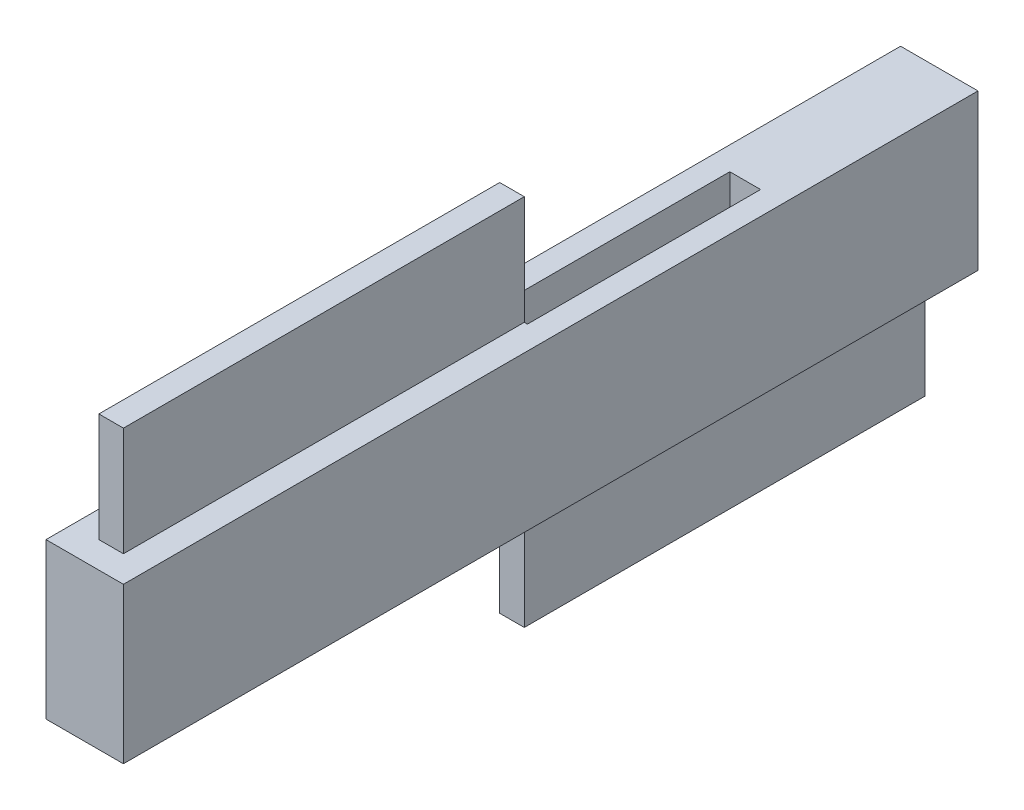
ISO-10303-21;
HEADER;
FILE_DESCRIPTION(('STEP AP214'),'2;1');
FILE_NAME('part.step','',(''),(''),'','','');
FILE_SCHEMA(('AUTOMOTIVE_DESIGN { 1 0 10303 214 1 1 1 1 }'));
ENDSEC;
DATA;
#1=APPLICATION_CONTEXT('core data for automotive mechanical design processes');
#2=APPLICATION_PROTOCOL_DEFINITION('international standard','automotive_design',2000,#1);
#3=PRODUCT_CONTEXT('',#1,'mechanical');
#4=PRODUCT('Part','Part','',(#3));
#5=PRODUCT_RELATED_PRODUCT_CATEGORY('part','',(#4));
#6=PRODUCT_DEFINITION_FORMATION('','',#4);
#7=PRODUCT_DEFINITION_CONTEXT('part definition',#1,'design');
#8=PRODUCT_DEFINITION('design','',#6,#7);
#9=PRODUCT_DEFINITION_SHAPE('','',#8);
#10=(LENGTH_UNIT() NAMED_UNIT(*) SI_UNIT(.MILLI.,.METRE.));
#11=(NAMED_UNIT(*) PLANE_ANGLE_UNIT() SI_UNIT($,.RADIAN.));
#12=(NAMED_UNIT(*) SI_UNIT($,.STERADIAN.) SOLID_ANGLE_UNIT());
#13=UNCERTAINTY_MEASURE_WITH_UNIT(LENGTH_MEASURE(1.E-05),#10,'distance_accuracy_value','');
#14=(GEOMETRIC_REPRESENTATION_CONTEXT(3) GLOBAL_UNCERTAINTY_ASSIGNED_CONTEXT((#13)) GLOBAL_UNIT_ASSIGNED_CONTEXT((#10,
#11,#12)) REPRESENTATION_CONTEXT('',''));
#15=CARTESIAN_POINT('',(0.,0.,0.));
#16=DIRECTION('',(0.,0.,1.));
#17=DIRECTION('',(1.,0.,0.));
#18=AXIS2_PLACEMENT_3D('',#15,#16,#17);
#19=CARTESIAN_POINT('',(0.,10.,0.));
#20=DIRECTION('',(0.,-1.,0.));
#21=DIRECTION('',(0.,0.,-1.));
#22=AXIS2_PLACEMENT_3D('',#19,#20,#21);
#23=PLANE('',#22);
#24=DIRECTION('',(0.,0.,1.));
#25=VECTOR('',#24,1.);
#26=CARTESIAN_POINT('',(-14.2963683314086,10.,24.442178114987));
#27=LINE('',#26,#25);
#28=CARTESIAN_POINT('',(-14.2963683314086,10.,-30.5296639851347));
#29=VERTEX_POINT('',#28);
#30=CARTESIAN_POINT('',(-14.2963683314086,10.,24.442178114987));
#31=VERTEX_POINT('',#30);
#32=EDGE_CURVE('E340',#29,#31,#27,.T.);
#33=ORIENTED_EDGE('',*,*,#32,.T.);
#34=DIRECTION('',(1.,0.,0.));
#35=VECTOR('',#34,1.);
#36=CARTESIAN_POINT('',(-9.31569807401334,10.,24.442178114987));
#37=LINE('',#36,#35);
#38=CARTESIAN_POINT('',(-9.31569807401334,10.,24.442178114987));
#39=VERTEX_POINT('',#38);
#40=EDGE_CURVE('E344',#31,#39,#37,.T.);
#41=ORIENTED_EDGE('',*,*,#40,.T.);
#42=DIRECTION('',(0.,0.,-1.));
#43=VECTOR('',#42,1.);
#44=CARTESIAN_POINT('',(-9.31569807401392,10.,-30.5296639851347));
#45=LINE('',#44,#43);
#46=CARTESIAN_POINT('',(-9.31569807401392,10.,-30.5296639851347));
#47=VERTEX_POINT('',#46);
#48=EDGE_CURVE('E348',#39,#47,#45,.T.);
#49=ORIENTED_EDGE('',*,*,#48,.T.);
#50=DIRECTION('',(-1.,0.,0.));
#51=VECTOR('',#50,1.);
#52=CARTESIAN_POINT('',(-14.2963683314086,10.,-30.5296639851347));
#53=LINE('',#52,#51);
#54=EDGE_CURVE('E351',#47,#29,#53,.T.);
#55=ORIENTED_EDGE('',*,*,#54,.T.);
#56=EDGE_LOOP('',(#33,#41,#49,#55));
#57=FACE_BOUND('',#56,.T.);
#58=DIRECTION('',(0.,0.,-1.));
#59=VECTOR('',#58,1.);
#60=CARTESIAN_POINT('',(-11.0156980740134,10.,22.742178114987));
#61=LINE('',#60,#59);
#62=CARTESIAN_POINT('',(-11.0156980740134,10.,22.742178114987));
#63=VERTEX_POINT('',#62);
#64=CARTESIAN_POINT('',(-11.0156980740135,10.,-3.04374293507385));
#65=VERTEX_POINT('',#64);
#66=EDGE_CURVE('E55',#63,#65,#61,.T.);
#67=ORIENTED_EDGE('',*,*,#66,.F.);
#68=DIRECTION('',(1.,0.,0.));
#69=VECTOR('',#68,1.);
#70=CARTESIAN_POINT('',(-12.5963683314086,10.,22.742178114987));
#71=LINE('',#70,#69);
#72=CARTESIAN_POINT('',(-12.5963683314086,10.,22.742178114987));
#73=VERTEX_POINT('',#72);
#74=EDGE_CURVE('E595',#73,#63,#71,.T.);
#75=ORIENTED_EDGE('',*,*,#74,.F.);
#76=DIRECTION('',(0.,0.,1.));
#77=VECTOR('',#76,1.);
#78=CARTESIAN_POINT('',(-12.5963683314086,10.,-3.04374293507385));
#79=LINE('',#78,#77);
#80=CARTESIAN_POINT('',(-12.5963683314086,10.,-3.04374293507385));
#81=VERTEX_POINT('',#80);
#82=EDGE_CURVE('E606',#81,#73,#79,.T.);
#83=ORIENTED_EDGE('',*,*,#82,.F.);
#84=DIRECTION('',(1.,0.,0.));
#85=VECTOR('',#84,1.);
#86=CARTESIAN_POINT('',(-12.7963683314086,10.,-3.04374293507385));
#87=LINE('',#86,#85);
#88=CARTESIAN_POINT('',(-12.7963683314086,10.,-3.04374293507385));
#89=VERTEX_POINT('',#88);
#90=EDGE_CURVE('E202',#89,#81,#87,.T.);
#91=ORIENTED_EDGE('',*,*,#90,.F.);
#92=DIRECTION('',(0.,0.,1.));
#93=VECTOR('',#92,1.);
#94=CARTESIAN_POINT('',(-12.7963683314086,10.,-18.0437429350739));
#95=LINE('',#94,#93);
#96=CARTESIAN_POINT('',(-12.7963683314086,10.,-18.0437429350739));
#97=VERTEX_POINT('',#96);
#98=EDGE_CURVE('E287',#97,#89,#95,.T.);
#99=ORIENTED_EDGE('',*,*,#98,.F.);
#100=DIRECTION('',(-1.,0.,0.));
#101=VECTOR('',#100,1.);
#102=CARTESIAN_POINT('',(-12.7963683314086,10.,-18.0437429350739));
#103=LINE('',#102,#101);
#104=CARTESIAN_POINT('',(-10.8156980740138,10.,-18.0437429350739));
#105=VERTEX_POINT('',#104);
#106=EDGE_CURVE('E302',#105,#97,#103,.T.);
#107=ORIENTED_EDGE('',*,*,#106,.F.);
#108=DIRECTION('',(0.,0.,-1.));
#109=VECTOR('',#108,1.);
#110=CARTESIAN_POINT('',(-10.8156980740136,10.,-3.04374293507385));
#111=LINE('',#110,#109);
#112=CARTESIAN_POINT('',(-10.8156980740136,10.,-3.04374293507385));
#113=VERTEX_POINT('',#112);
#114=EDGE_CURVE('E320',#113,#105,#111,.T.);
#115=ORIENTED_EDGE('',*,*,#114,.F.);
#116=EDGE_CURVE('E60',#65,#113,#87,.T.);
#117=ORIENTED_EDGE('',*,*,#116,.F.);
#118=EDGE_LOOP('',(#67,#75,#83,#91,#99,#107,#115,#117));
#119=FACE_BOUND('',#118,.T.);
#120=ADVANCED_FACE('F39',(#57,#119),#23,.F.);
#121=CARTESIAN_POINT('',(-12.7963683314086,3.,-3.04374293507385));
#122=DIRECTION('',(0.,0.,1.));
#123=DIRECTION('',(1.,0.,0.));
#124=AXIS2_PLACEMENT_3D('',#121,#122,#123);
#125=PLANE('',#124);
#126=DIRECTION('',(1.,0.,0.));
#127=VECTOR('',#126,1.);
#128=CARTESIAN_POINT('',(-10.8156980740136,7.,-3.04374293507385));
#129=LINE('',#128,#127);
#130=CARTESIAN_POINT('',(-12.7963683314086,7.,-3.04374293507385));
#131=VERTEX_POINT('',#130);
#132=CARTESIAN_POINT('',(-10.8156980740136,7.,-3.04374293507385));
#133=VERTEX_POINT('',#132);
#134=EDGE_CURVE('E264',#131,#133,#129,.T.);
#135=ORIENTED_EDGE('',*,*,#134,.F.);
#136=DIRECTION('',(0.,1.,0.));
#137=VECTOR('',#136,1.);
#138=CARTESIAN_POINT('',(-12.7963683314086,3.,-3.04374293507385));
#139=LINE('',#138,#137);
#140=EDGE_CURVE('E314',#131,#89,#139,.T.);
#141=ORIENTED_EDGE('',*,*,#140,.T.);
#142=ORIENTED_EDGE('',*,*,#90,.T.);
#143=DIRECTION('',(0.,-1.,0.));
#144=VECTOR('',#143,1.);
#145=CARTESIAN_POINT('',(-12.5963683314086,17.,-3.04374293507385));
#146=LINE('',#145,#144);
#147=CARTESIAN_POINT('',(-12.5963683314086,17.,-3.04374293507385));
#148=VERTEX_POINT('',#147);
#149=EDGE_CURVE('E180',#148,#81,#146,.T.);
#150=ORIENTED_EDGE('',*,*,#149,.F.);
#151=DIRECTION('',(-1.,0.,0.));
#152=VECTOR('',#151,1.);
#153=CARTESIAN_POINT('',(-11.0156980740136,17.,-3.04374293507385));
#154=LINE('',#153,#152);
#155=CARTESIAN_POINT('',(-11.0156980740136,17.,-3.04374293507385));
#156=VERTEX_POINT('',#155);
#157=EDGE_CURVE('E187',#156,#148,#154,.T.);
#158=ORIENTED_EDGE('',*,*,#157,.F.);
#159=DIRECTION('',(0.,-1.,0.));
#160=VECTOR('',#159,1.);
#161=CARTESIAN_POINT('',(-11.0156980740136,17.,-3.04374293507385));
#162=LINE('',#161,#160);
#163=EDGE_CURVE('E592',#156,#65,#162,.T.);
#164=ORIENTED_EDGE('',*,*,#163,.T.);
#165=ORIENTED_EDGE('',*,*,#116,.T.);
#166=DIRECTION('',(0.,1.,0.));
#167=VECTOR('',#166,1.);
#168=CARTESIAN_POINT('',(-10.8156980740136,3.,-3.04374293507385));
#169=LINE('',#168,#167);
#170=EDGE_CURVE('E334',#133,#113,#169,.T.);
#171=ORIENTED_EDGE('',*,*,#170,.F.);
#172=EDGE_LOOP('',(#135,#141,#142,#150,#158,#164,#165,#171));
#173=FACE_BOUND('',#172,.T.);
#174=ADVANCED_FACE('F200',(#173),#125,.F.);
#175=CARTESIAN_POINT('',(-14.2963683314086,10.,24.442178114987));
#176=DIRECTION('',(1.,0.,0.));
#177=DIRECTION('',(0.,0.,-1.));
#178=AXIS2_PLACEMENT_3D('',#175,#176,#177);
#179=PLANE('',#178);
#180=DIRECTION('',(0.,0.,1.));
#181=VECTOR('',#180,1.);
#182=CARTESIAN_POINT('',(-14.2963683314086,0.,24.442178114987));
#183=LINE('',#182,#181);
#184=CARTESIAN_POINT('',(-14.2963683314086,0.,-30.5296639851347));
#185=VERTEX_POINT('',#184);
#186=CARTESIAN_POINT('',(-14.2963683314086,0.,24.442178114987));
#187=VERTEX_POINT('',#186);
#188=EDGE_CURVE('E330',#185,#187,#183,.T.);
#189=ORIENTED_EDGE('',*,*,#188,.T.);
#190=DIRECTION('',(0.,-1.,0.));
#191=VECTOR('',#190,1.);
#192=CARTESIAN_POINT('',(-14.2963683314086,10.,24.442178114987));
#193=LINE('',#192,#191);
#194=EDGE_CURVE('E11',#31,#187,#193,.T.);
#195=ORIENTED_EDGE('',*,*,#194,.F.);
#196=ORIENTED_EDGE('',*,*,#32,.F.);
#197=DIRECTION('',(0.,-1.,0.));
#198=VECTOR('',#197,1.);
#199=CARTESIAN_POINT('',(-14.2963683314086,10.,-30.5296639851347));
#200=LINE('',#199,#198);
#201=EDGE_CURVE('E354',#29,#185,#200,.T.);
#202=ORIENTED_EDGE('',*,*,#201,.T.);
#203=EDGE_LOOP('',(#189,#195,#196,#202));
#204=FACE_BOUND('',#203,.T.);
#205=ADVANCED_FACE('F41',(#204),#179,.F.);
#206=CARTESIAN_POINT('',(-9.31569807401334,10.,24.442178114987));
#207=DIRECTION('',(0.,0.,-1.));
#208=DIRECTION('',(-1.,0.,0.));
#209=AXIS2_PLACEMENT_3D('',#206,#207,#208);
#210=PLANE('',#209);
#211=DIRECTION('',(1.,0.,0.));
#212=VECTOR('',#211,1.);
#213=CARTESIAN_POINT('',(-9.31569807401334,0.,24.442178114987));
#214=LINE('',#213,#212);
#215=CARTESIAN_POINT('',(-9.31569807401334,0.,24.442178114987));
#216=VERTEX_POINT('',#215);
#217=EDGE_CURVE('E358',#187,#216,#214,.T.);
#218=ORIENTED_EDGE('',*,*,#217,.T.);
#219=DIRECTION('',(0.,-1.,0.));
#220=VECTOR('',#219,1.);
#221=CARTESIAN_POINT('',(-9.31569807401334,10.,24.442178114987));
#222=LINE('',#221,#220);
#223=EDGE_CURVE('E48',#39,#216,#222,.T.);
#224=ORIENTED_EDGE('',*,*,#223,.F.);
#225=ORIENTED_EDGE('',*,*,#40,.F.);
#226=ORIENTED_EDGE('',*,*,#194,.T.);
#227=EDGE_LOOP('',(#218,#224,#225,#226));
#228=FACE_BOUND('',#227,.T.);
#229=ADVANCED_FACE('F393',(#228),#210,.F.);
#230=CARTESIAN_POINT('',(-9.31569807401392,10.,-30.5296639851347));
#231=DIRECTION('',(-1.,0.,0.));
#232=DIRECTION('',(0.,0.,1.));
#233=AXIS2_PLACEMENT_3D('',#230,#231,#232);
#234=PLANE('',#233);
#235=DIRECTION('',(0.,0.,-1.));
#236=VECTOR('',#235,1.);
#237=CARTESIAN_POINT('',(-9.31569807401392,0.,-30.5296639851347));
#238=LINE('',#237,#236);
#239=CARTESIAN_POINT('',(-9.31569807401392,0.,-30.5296639851347));
#240=VERTEX_POINT('',#239);
#241=EDGE_CURVE('E361',#216,#240,#238,.T.);
#242=ORIENTED_EDGE('',*,*,#241,.T.);
#243=DIRECTION('',(0.,-1.,0.));
#244=VECTOR('',#243,1.);
#245=CARTESIAN_POINT('',(-9.31569807401392,10.,-30.5296639851347));
#246=LINE('',#245,#244);
#247=EDGE_CURVE('E369',#47,#240,#246,.T.);
#248=ORIENTED_EDGE('',*,*,#247,.F.);
#249=ORIENTED_EDGE('',*,*,#48,.F.);
#250=ORIENTED_EDGE('',*,*,#223,.T.);
#251=EDGE_LOOP('',(#242,#248,#249,#250));
#252=FACE_BOUND('',#251,.T.);
#253=ADVANCED_FACE('F378',(#252),#234,.F.);
#254=CARTESIAN_POINT('',(-14.2963683314086,10.,-30.5296639851347));
#255=DIRECTION('',(0.,0.,1.));
#256=DIRECTION('',(1.,0.,0.));
#257=AXIS2_PLACEMENT_3D('',#254,#255,#256);
#258=PLANE('',#257);
#259=DIRECTION('',(-1.,0.,0.));
#260=VECTOR('',#259,1.);
#261=CARTESIAN_POINT('',(-14.2963683314086,0.,-30.5296639851347));
#262=LINE('',#261,#260);
#263=EDGE_CURVE('E345',#240,#185,#262,.T.);
#264=ORIENTED_EDGE('',*,*,#263,.T.);
#265=ORIENTED_EDGE('',*,*,#201,.F.);
#266=ORIENTED_EDGE('',*,*,#54,.F.);
#267=ORIENTED_EDGE('',*,*,#247,.T.);
#268=EDGE_LOOP('',(#264,#265,#266,#267));
#269=FACE_BOUND('',#268,.T.);
#270=ADVANCED_FACE('F387',(#269),#258,.F.);
#271=CARTESIAN_POINT('',(0.,0.,0.));
#272=DIRECTION('',(0.,-1.,0.));
#273=DIRECTION('',(0.,0.,-1.));
#274=AXIS2_PLACEMENT_3D('',#271,#272,#273);
#275=PLANE('',#274);
#276=DIRECTION('',(0.,0.,1.));
#277=VECTOR('',#276,1.);
#278=CARTESIAN_POINT('',(-11.0156980740139,0.,-28.8296639851347));
#279=LINE('',#278,#277);
#280=CARTESIAN_POINT('',(-11.0156980740139,0.,-28.8296639851347));
#281=VERTEX_POINT('',#280);
#282=CARTESIAN_POINT('',(-11.0156980740138,0.,-3.04374293507385));
#283=VERTEX_POINT('',#282);
#284=EDGE_CURVE('E204',#281,#283,#279,.T.);
#285=ORIENTED_EDGE('',*,*,#284,.F.);
#286=DIRECTION('',(1.,0.,0.));
#287=VECTOR('',#286,1.);
#288=CARTESIAN_POINT('',(-12.5963683314086,0.,-28.8296639851347));
#289=LINE('',#288,#287);
#290=CARTESIAN_POINT('',(-12.5963683314086,0.,-28.8296639851347));
#291=VERTEX_POINT('',#290);
#292=EDGE_CURVE('E209',#291,#281,#289,.T.);
#293=ORIENTED_EDGE('',*,*,#292,.F.);
#294=DIRECTION('',(0.,0.,-1.));
#295=VECTOR('',#294,1.);
#296=CARTESIAN_POINT('',(-12.5963683314086,0.,-3.04374293507385));
#297=LINE('',#296,#295);
#298=CARTESIAN_POINT('',(-12.5963683314086,0.,-3.04374293507385));
#299=VERTEX_POINT('',#298);
#300=EDGE_CURVE('E220',#299,#291,#297,.T.);
#301=ORIENTED_EDGE('',*,*,#300,.F.);
#302=DIRECTION('',(1.,0.,0.));
#303=VECTOR('',#302,1.);
#304=CARTESIAN_POINT('',(-10.8156980740136,0.,-3.04374293507385));
#305=LINE('',#304,#303);
#306=CARTESIAN_POINT('',(-12.7963683314086,0.,-3.04374293507385));
#307=VERTEX_POINT('',#306);
#308=EDGE_CURVE('E257',#307,#299,#305,.T.);
#309=ORIENTED_EDGE('',*,*,#308,.F.);
#310=DIRECTION('',(0.,0.,-1.));
#311=VECTOR('',#310,1.);
#312=CARTESIAN_POINT('',(-12.7963683314086,0.,22.942178114987));
#313=LINE('',#312,#311);
#314=CARTESIAN_POINT('',(-12.7963683314086,0.,22.942178114987));
#315=VERTEX_POINT('',#314);
#316=EDGE_CURVE('E275',#315,#307,#313,.T.);
#317=ORIENTED_EDGE('',*,*,#316,.F.);
#318=DIRECTION('',(-1.,0.,0.));
#319=VECTOR('',#318,1.);
#320=CARTESIAN_POINT('',(-10.8156980740134,0.,22.942178114987));
#321=LINE('',#320,#319);
#322=CARTESIAN_POINT('',(-10.8156980740134,0.,22.942178114987));
#323=VERTEX_POINT('',#322);
#324=EDGE_CURVE('E271',#323,#315,#321,.T.);
#325=ORIENTED_EDGE('',*,*,#324,.F.);
#326=DIRECTION('',(0.,0.,1.));
#327=VECTOR('',#326,1.);
#328=CARTESIAN_POINT('',(-10.8156980740136,0.,-3.04374293507385));
#329=LINE('',#328,#327);
#330=CARTESIAN_POINT('',(-10.8156980740136,0.,-3.04374293507385));
#331=VERTEX_POINT('',#330);
#332=EDGE_CURVE('E240',#331,#323,#329,.T.);
#333=ORIENTED_EDGE('',*,*,#332,.F.);
#334=EDGE_CURVE('E279',#283,#331,#305,.T.);
#335=ORIENTED_EDGE('',*,*,#334,.F.);
#336=EDGE_LOOP('',(#285,#293,#301,#309,#317,#325,#333,#335));
#337=FACE_BOUND('',#336,.T.);
#338=ORIENTED_EDGE('',*,*,#188,.F.);
#339=ORIENTED_EDGE('',*,*,#263,.F.);
#340=ORIENTED_EDGE('',*,*,#241,.F.);
#341=ORIENTED_EDGE('',*,*,#217,.F.);
#342=EDGE_LOOP('',(#338,#339,#340,#341));
#343=FACE_BOUND('',#342,.T.);
#344=ADVANCED_FACE('F384',(#337,#343),#275,.T.);
#345=CARTESIAN_POINT('',(-12.7963683314086,3.,-18.0437429350739));
#346=DIRECTION('',(-1.,0.,0.));
#347=DIRECTION('',(0.,0.,1.));
#348=AXIS2_PLACEMENT_3D('',#345,#346,#347);
#349=PLANE('',#348);
#350=ORIENTED_EDGE('',*,*,#98,.T.);
#351=ORIENTED_EDGE('',*,*,#140,.F.);
#352=DIRECTION('',(0.,0.,-1.));
#353=VECTOR('',#352,1.);
#354=CARTESIAN_POINT('',(-12.7963683314086,7.,22.942178114987));
#355=LINE('',#354,#353);
#356=CARTESIAN_POINT('',(-12.7963683314086,7.,22.942178114987));
#357=VERTEX_POINT('',#356);
#358=EDGE_CURVE('E261',#357,#131,#355,.T.);
#359=ORIENTED_EDGE('',*,*,#358,.F.);
#360=DIRECTION('',(0.,-1.,0.));
#361=VECTOR('',#360,1.);
#362=CARTESIAN_POINT('',(-12.7963683314086,7.,22.942178114987));
#363=LINE('',#362,#361);
#364=EDGE_CURVE('E291',#357,#315,#363,.T.);
#365=ORIENTED_EDGE('',*,*,#364,.T.);
#366=ORIENTED_EDGE('',*,*,#316,.T.);
#367=DIRECTION('',(0.,-1.,0.));
#368=VECTOR('',#367,1.);
#369=CARTESIAN_POINT('',(-12.7963683314086,7.,-3.04374293507385));
#370=LINE('',#369,#368);
#371=CARTESIAN_POINT('',(-12.7963683314086,3.,-3.04374293507385));
#372=VERTEX_POINT('',#371);
#373=EDGE_CURVE('E288',#372,#307,#370,.T.);
#374=ORIENTED_EDGE('',*,*,#373,.F.);
#375=DIRECTION('',(0.,0.,1.));
#376=VECTOR('',#375,1.);
#377=CARTESIAN_POINT('',(-12.7963683314086,3.,-18.0437429350739));
#378=LINE('',#377,#376);
#379=CARTESIAN_POINT('',(-12.7963683314086,3.,-18.0437429350739));
#380=VERTEX_POINT('',#379);
#381=EDGE_CURVE('E297',#380,#372,#378,.T.);
#382=ORIENTED_EDGE('',*,*,#381,.F.);
#383=DIRECTION('',(0.,1.,0.));
#384=VECTOR('',#383,1.);
#385=CARTESIAN_POINT('',(-12.7963683314086,3.,-18.0437429350739));
#386=LINE('',#385,#384);
#387=EDGE_CURVE('E327',#380,#97,#386,.T.);
#388=ORIENTED_EDGE('',*,*,#387,.T.);
#389=EDGE_LOOP('',(#350,#351,#359,#365,#366,#374,#382,#388));
#390=FACE_BOUND('',#389,.T.);
#391=ADVANCED_FACE('F410',(#390),#349,.F.);
#392=CARTESIAN_POINT('',(-12.7963683314086,3.,-18.0437429350739));
#393=DIRECTION('',(0.,0.,-1.));
#394=DIRECTION('',(-1.,0.,0.));
#395=AXIS2_PLACEMENT_3D('',#392,#393,#394);
#396=PLANE('',#395);
#397=ORIENTED_EDGE('',*,*,#106,.T.);
#398=ORIENTED_EDGE('',*,*,#387,.F.);
#399=DIRECTION('',(-1.,0.,0.));
#400=VECTOR('',#399,1.);
#401=CARTESIAN_POINT('',(-12.7963683314086,3.,-18.0437429350739));
#402=LINE('',#401,#400);
#403=CARTESIAN_POINT('',(-10.8156980740138,3.,-18.0437429350739));
#404=VERTEX_POINT('',#403);
#405=EDGE_CURVE('E310',#404,#380,#402,.T.);
#406=ORIENTED_EDGE('',*,*,#405,.F.);
#407=DIRECTION('',(0.,1.,0.));
#408=VECTOR('',#407,1.);
#409=CARTESIAN_POINT('',(-10.8156980740138,3.,-18.0437429350739));
#410=LINE('',#409,#408);
#411=EDGE_CURVE('E331',#404,#105,#410,.T.);
#412=ORIENTED_EDGE('',*,*,#411,.T.);
#413=EDGE_LOOP('',(#397,#398,#406,#412));
#414=FACE_BOUND('',#413,.T.);
#415=ADVANCED_FACE('F435',(#414),#396,.F.);
#416=CARTESIAN_POINT('',(-10.8156980740136,3.,-3.04374293507385));
#417=DIRECTION('',(1.,0.,0.));
#418=DIRECTION('',(0.,0.,-1.));
#419=AXIS2_PLACEMENT_3D('',#416,#417,#418);
#420=PLANE('',#419);
#421=ORIENTED_EDGE('',*,*,#114,.T.);
#422=ORIENTED_EDGE('',*,*,#411,.F.);
#423=DIRECTION('',(0.,0.,-1.));
#424=VECTOR('',#423,1.);
#425=CARTESIAN_POINT('',(-10.8156980740136,3.,-3.04374293507385));
#426=LINE('',#425,#424);
#427=CARTESIAN_POINT('',(-10.8156980740136,3.,-3.04374293507385));
#428=VERTEX_POINT('',#427);
#429=EDGE_CURVE('E306',#428,#404,#426,.T.);
#430=ORIENTED_EDGE('',*,*,#429,.F.);
#431=DIRECTION('',(0.,-1.,0.));
#432=VECTOR('',#431,1.);
#433=CARTESIAN_POINT('',(-10.8156980740136,7.,-3.04374293507385));
#434=LINE('',#433,#432);
#435=EDGE_CURVE('E283',#428,#331,#434,.T.);
#436=ORIENTED_EDGE('',*,*,#435,.T.);
#437=ORIENTED_EDGE('',*,*,#332,.T.);
#438=DIRECTION('',(0.,-1.,0.));
#439=VECTOR('',#438,1.);
#440=CARTESIAN_POINT('',(-10.8156980740134,7.,22.942178114987));
#441=LINE('',#440,#439);
#442=CARTESIAN_POINT('',(-10.8156980740134,7.,22.942178114987));
#443=VERTEX_POINT('',#442);
#444=EDGE_CURVE('E268',#443,#323,#441,.T.);
#445=ORIENTED_EDGE('',*,*,#444,.F.);
#446=DIRECTION('',(0.,0.,1.));
#447=VECTOR('',#446,1.);
#448=CARTESIAN_POINT('',(-10.8156980740136,7.,-3.04374293507385));
#449=LINE('',#448,#447);
#450=EDGE_CURVE('E252',#133,#443,#449,.T.);
#451=ORIENTED_EDGE('',*,*,#450,.F.);
#452=ORIENTED_EDGE('',*,*,#170,.T.);
#453=EDGE_LOOP('',(#421,#422,#430,#436,#437,#445,#451,#452));
#454=FACE_BOUND('',#453,.T.);
#455=ADVANCED_FACE('F442',(#454),#420,.F.);
#456=CARTESIAN_POINT('',(0.,3.,0.));
#457=DIRECTION('',(0.,1.,0.));
#458=DIRECTION('',(0.,0.,1.));
#459=AXIS2_PLACEMENT_3D('',#456,#457,#458);
#460=PLANE('',#459);
#461=ORIENTED_EDGE('',*,*,#381,.T.);
#462=DIRECTION('',(1.,0.,0.));
#463=VECTOR('',#462,1.);
#464=CARTESIAN_POINT('',(-12.7963683314086,3.,-3.04374293507385));
#465=LINE('',#464,#463);
#466=EDGE_CURVE('E301',#372,#428,#465,.T.);
#467=ORIENTED_EDGE('',*,*,#466,.T.);
#468=ORIENTED_EDGE('',*,*,#429,.T.);
#469=ORIENTED_EDGE('',*,*,#405,.T.);
#470=EDGE_LOOP('',(#461,#467,#468,#469));
#471=FACE_BOUND('',#470,.T.);
#472=ADVANCED_FACE('F449',(#471),#460,.T.);
#473=CARTESIAN_POINT('',(-10.8156980740136,7.,-3.04374293507385));
#474=DIRECTION('',(0.,0.,-1.));
#475=DIRECTION('',(-1.,0.,0.));
#476=AXIS2_PLACEMENT_3D('',#473,#474,#475);
#477=PLANE('',#476);
#478=ORIENTED_EDGE('',*,*,#466,.F.);
#479=ORIENTED_EDGE('',*,*,#373,.T.);
#480=ORIENTED_EDGE('',*,*,#308,.T.);
#481=DIRECTION('',(0.,1.,0.));
#482=VECTOR('',#481,1.);
#483=CARTESIAN_POINT('',(-12.5963683314086,-7.,-3.04374293507385));
#484=LINE('',#483,#482);
#485=CARTESIAN_POINT('',(-12.5963683314086,-7.,-3.04374293507385));
#486=VERTEX_POINT('',#485);
#487=EDGE_CURVE('E236',#486,#299,#484,.T.);
#488=ORIENTED_EDGE('',*,*,#487,.F.);
#489=DIRECTION('',(1.,0.,0.));
#490=VECTOR('',#489,1.);
#491=CARTESIAN_POINT('',(-12.5963683314086,-7.,-3.04374293507385));
#492=LINE('',#491,#490);
#493=CARTESIAN_POINT('',(-11.0156980740136,-7.,-3.04374293507385));
#494=VERTEX_POINT('',#493);
#495=EDGE_CURVE('E215',#486,#494,#492,.T.);
#496=ORIENTED_EDGE('',*,*,#495,.T.);
#497=DIRECTION('',(0.,1.,0.));
#498=VECTOR('',#497,1.);
#499=CARTESIAN_POINT('',(-11.0156980740136,-7.,-3.04374293507385));
#500=LINE('',#499,#498);
#501=EDGE_CURVE('E228',#494,#283,#500,.T.);
#502=ORIENTED_EDGE('',*,*,#501,.T.);
#503=ORIENTED_EDGE('',*,*,#334,.T.);
#504=ORIENTED_EDGE('',*,*,#435,.F.);
#505=EDGE_LOOP('',(#478,#479,#480,#488,#496,#502,#503,#504));
#506=FACE_BOUND('',#505,.T.);
#507=ADVANCED_FACE('F457',(#506),#477,.F.);
#508=CARTESIAN_POINT('',(-10.8156980740134,7.,22.942178114987));
#509=DIRECTION('',(0.,0.,1.));
#510=DIRECTION('',(1.,0.,0.));
#511=AXIS2_PLACEMENT_3D('',#508,#509,#510);
#512=PLANE('',#511);
#513=ORIENTED_EDGE('',*,*,#324,.T.);
#514=ORIENTED_EDGE('',*,*,#364,.F.);
#515=DIRECTION('',(-1.,0.,0.));
#516=VECTOR('',#515,1.);
#517=CARTESIAN_POINT('',(-10.8156980740134,7.,22.942178114987));
#518=LINE('',#517,#516);
#519=EDGE_CURVE('E256',#443,#357,#518,.T.);
#520=ORIENTED_EDGE('',*,*,#519,.F.);
#521=ORIENTED_EDGE('',*,*,#444,.T.);
#522=EDGE_LOOP('',(#513,#514,#520,#521));
#523=FACE_BOUND('',#522,.T.);
#524=ADVANCED_FACE('F463',(#523),#512,.F.);
#525=CARTESIAN_POINT('',(0.,7.,0.));
#526=DIRECTION('',(0.,-1.,0.));
#527=DIRECTION('',(0.,0.,-1.));
#528=AXIS2_PLACEMENT_3D('',#525,#526,#527);
#529=PLANE('',#528);
#530=ORIENTED_EDGE('',*,*,#450,.T.);
#531=ORIENTED_EDGE('',*,*,#519,.T.);
#532=ORIENTED_EDGE('',*,*,#358,.T.);
#533=ORIENTED_EDGE('',*,*,#134,.T.);
#534=EDGE_LOOP('',(#530,#531,#532,#533));
#535=FACE_BOUND('',#534,.T.);
#536=ADVANCED_FACE('F466',(#535),#529,.T.);
#537=CARTESIAN_POINT('',(-12.5963683314086,-7.,-3.04374293507385));
#538=DIRECTION('',(1.,0.,0.));
#539=DIRECTION('',(0.,0.,-1.));
#540=AXIS2_PLACEMENT_3D('',#537,#538,#539);
#541=PLANE('',#540);
#542=ORIENTED_EDGE('',*,*,#300,.T.);
#543=DIRECTION('',(0.,1.,0.));
#544=VECTOR('',#543,1.);
#545=CARTESIAN_POINT('',(-12.5963683314086,-7.,-28.8296639851347));
#546=LINE('',#545,#544);
#547=CARTESIAN_POINT('',(-12.5963683314086,-7.,-28.8296639851347));
#548=VERTEX_POINT('',#547);
#549=EDGE_CURVE('E241',#548,#291,#546,.T.);
#550=ORIENTED_EDGE('',*,*,#549,.F.);
#551=DIRECTION('',(0.,0.,-1.));
#552=VECTOR('',#551,1.);
#553=CARTESIAN_POINT('',(-12.5963683314086,-7.,-3.04374293507385));
#554=LINE('',#553,#552);
#555=EDGE_CURVE('E226',#486,#548,#554,.T.);
#556=ORIENTED_EDGE('',*,*,#555,.F.);
#557=ORIENTED_EDGE('',*,*,#487,.T.);
#558=EDGE_LOOP('',(#542,#550,#556,#557));
#559=FACE_BOUND('',#558,.T.);
#560=ADVANCED_FACE('F473',(#559),#541,.F.);
#561=CARTESIAN_POINT('',(-12.5963683314086,-7.,-28.8296639851347));
#562=DIRECTION('',(0.,0.,1.));
#563=DIRECTION('',(1.,0.,0.));
#564=AXIS2_PLACEMENT_3D('',#561,#562,#563);
#565=PLANE('',#564);
#566=ORIENTED_EDGE('',*,*,#292,.T.);
#567=DIRECTION('',(0.,1.,0.));
#568=VECTOR('',#567,1.);
#569=CARTESIAN_POINT('',(-11.0156980740139,-7.,-28.8296639851347));
#570=LINE('',#569,#568);
#571=CARTESIAN_POINT('',(-11.0156980740139,-7.,-28.8296639851347));
#572=VERTEX_POINT('',#571);
#573=EDGE_CURVE('E245',#572,#281,#570,.T.);
#574=ORIENTED_EDGE('',*,*,#573,.F.);
#575=DIRECTION('',(1.,0.,0.));
#576=VECTOR('',#575,1.);
#577=CARTESIAN_POINT('',(-12.5963683314086,-7.,-28.8296639851347));
#578=LINE('',#577,#576);
#579=EDGE_CURVE('E223',#548,#572,#578,.T.);
#580=ORIENTED_EDGE('',*,*,#579,.F.);
#581=ORIENTED_EDGE('',*,*,#549,.T.);
#582=EDGE_LOOP('',(#566,#574,#580,#581));
#583=FACE_BOUND('',#582,.T.);
#584=ADVANCED_FACE('F496',(#583),#565,.F.);
#585=CARTESIAN_POINT('',(-11.0156980740139,-7.,-28.8296639851347));
#586=DIRECTION('',(-1.,0.,0.));
#587=DIRECTION('',(0.,0.,1.));
#588=AXIS2_PLACEMENT_3D('',#585,#586,#587);
#589=PLANE('',#588);
#590=ORIENTED_EDGE('',*,*,#284,.T.);
#591=ORIENTED_EDGE('',*,*,#501,.F.);
#592=DIRECTION('',(0.,0.,1.));
#593=VECTOR('',#592,1.);
#594=CARTESIAN_POINT('',(-11.0156980740139,-7.,-28.8296639851347));
#595=LINE('',#594,#593);
#596=EDGE_CURVE('E219',#572,#494,#595,.T.);
#597=ORIENTED_EDGE('',*,*,#596,.F.);
#598=ORIENTED_EDGE('',*,*,#573,.T.);
#599=EDGE_LOOP('',(#590,#591,#597,#598));
#600=FACE_BOUND('',#599,.T.);
#601=ADVANCED_FACE('F504',(#600),#589,.F.);
#602=CARTESIAN_POINT('',(0.,-7.,0.));
#603=DIRECTION('',(0.,-1.,0.));
#604=DIRECTION('',(0.,0.,-1.));
#605=AXIS2_PLACEMENT_3D('',#602,#603,#604);
#606=PLANE('',#605);
#607=ORIENTED_EDGE('',*,*,#495,.F.);
#608=ORIENTED_EDGE('',*,*,#555,.T.);
#609=ORIENTED_EDGE('',*,*,#579,.T.);
#610=ORIENTED_EDGE('',*,*,#596,.T.);
#611=EDGE_LOOP('',(#607,#608,#609,#610));
#612=FACE_BOUND('',#611,.T.);
#613=ADVANCED_FACE('F512',(#612),#606,.T.);
#614=CARTESIAN_POINT('',(-12.5963683314086,17.,-3.04374293507385));
#615=DIRECTION('',(1.,0.,0.));
#616=DIRECTION('',(0.,0.,-1.));
#617=AXIS2_PLACEMENT_3D('',#614,#615,#616);
#618=PLANE('',#617);
#619=ORIENTED_EDGE('',*,*,#82,.T.);
#620=DIRECTION('',(0.,-1.,0.));
#621=VECTOR('',#620,1.);
#622=CARTESIAN_POINT('',(-12.5963683314086,17.,22.742178114987));
#623=LINE('',#622,#621);
#624=CARTESIAN_POINT('',(-12.5963683314086,17.,22.742178114987));
#625=VERTEX_POINT('',#624);
#626=EDGE_CURVE('E182',#625,#73,#623,.T.);
#627=ORIENTED_EDGE('',*,*,#626,.F.);
#628=DIRECTION('',(0.,0.,1.));
#629=VECTOR('',#628,1.);
#630=CARTESIAN_POINT('',(-12.5963683314086,17.,-3.04374293507385));
#631=LINE('',#630,#629);
#632=EDGE_CURVE('E175',#148,#625,#631,.T.);
#633=ORIENTED_EDGE('',*,*,#632,.F.);
#634=ORIENTED_EDGE('',*,*,#149,.T.);
#635=EDGE_LOOP('',(#619,#627,#633,#634));
#636=FACE_BOUND('',#635,.T.);
#637=ADVANCED_FACE('F178',(#636),#618,.F.);
#638=CARTESIAN_POINT('',(-12.5963683314086,17.,22.742178114987));
#639=DIRECTION('',(0.,0.,-1.));
#640=DIRECTION('',(-1.,0.,0.));
#641=AXIS2_PLACEMENT_3D('',#638,#639,#640);
#642=PLANE('',#641);
#643=ORIENTED_EDGE('',*,*,#74,.T.);
#644=DIRECTION('',(0.,-1.,0.));
#645=VECTOR('',#644,1.);
#646=CARTESIAN_POINT('',(-11.0156980740134,17.,22.742178114987));
#647=LINE('',#646,#645);
#648=CARTESIAN_POINT('',(-11.0156980740134,17.,22.742178114987));
#649=VERTEX_POINT('',#648);
#650=EDGE_CURVE('E211',#649,#63,#647,.T.);
#651=ORIENTED_EDGE('',*,*,#650,.F.);
#652=DIRECTION('',(1.,0.,0.));
#653=VECTOR('',#652,1.);
#654=CARTESIAN_POINT('',(-12.5963683314086,17.,22.742178114987));
#655=LINE('',#654,#653);
#656=EDGE_CURVE('E186',#625,#649,#655,.T.);
#657=ORIENTED_EDGE('',*,*,#656,.F.);
#658=ORIENTED_EDGE('',*,*,#626,.T.);
#659=EDGE_LOOP('',(#643,#651,#657,#658));
#660=FACE_BOUND('',#659,.T.);
#661=ADVANCED_FACE('F524',(#660),#642,.F.);
#662=CARTESIAN_POINT('',(-11.0156980740134,17.,22.742178114987));
#663=DIRECTION('',(-1.,0.,0.));
#664=DIRECTION('',(0.,0.,1.));
#665=AXIS2_PLACEMENT_3D('',#662,#663,#664);
#666=PLANE('',#665);
#667=ORIENTED_EDGE('',*,*,#66,.T.);
#668=ORIENTED_EDGE('',*,*,#163,.F.);
#669=DIRECTION('',(0.,0.,-1.));
#670=VECTOR('',#669,1.);
#671=CARTESIAN_POINT('',(-11.0156980740134,17.,22.742178114987));
#672=LINE('',#671,#670);
#673=EDGE_CURVE('E192',#649,#156,#672,.T.);
#674=ORIENTED_EDGE('',*,*,#673,.F.);
#675=ORIENTED_EDGE('',*,*,#650,.T.);
#676=EDGE_LOOP('',(#667,#668,#674,#675));
#677=FACE_BOUND('',#676,.T.);
#678=ADVANCED_FACE('F531',(#677),#666,.F.);
#679=CARTESIAN_POINT('',(0.,17.,0.));
#680=DIRECTION('',(0.,1.,0.));
#681=DIRECTION('',(0.,0.,1.));
#682=AXIS2_PLACEMENT_3D('',#679,#680,#681);
#683=PLANE('',#682);
#684=ORIENTED_EDGE('',*,*,#157,.T.);
#685=ORIENTED_EDGE('',*,*,#632,.T.);
#686=ORIENTED_EDGE('',*,*,#656,.T.);
#687=ORIENTED_EDGE('',*,*,#673,.T.);
#688=EDGE_LOOP('',(#684,#685,#686,#687));
#689=FACE_BOUND('',#688,.T.);
#690=ADVANCED_FACE('F190',(#689),#683,.T.);
#691=CLOSED_SHELL('',(#120,#174,#205,#229,#253,#270,#344,#391,#415,#455,#472,#507,#524,#536,
#560,#584,#601,#613,#637,#661,#678,#690));
#692=MANIFOLD_SOLID_BREP('B2',#691);
#693=ADVANCED_BREP_SHAPE_REPRESENTATION('',(#18,#692),#14);
#694=SHAPE_DEFINITION_REPRESENTATION(#9,#693);
ENDSEC;
END-ISO-10303-21;
